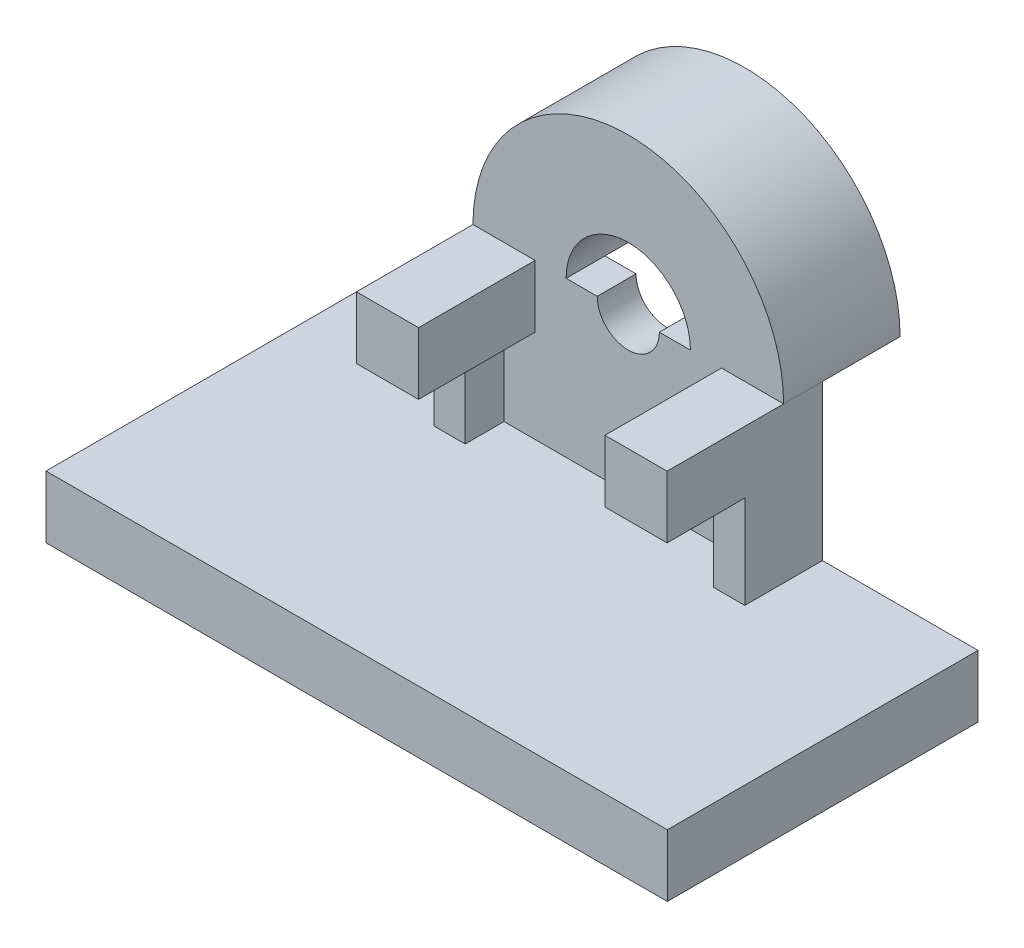
ISO-10303-21;
HEADER;
FILE_DESCRIPTION(('STEP AP214'),'2;1');
FILE_NAME('part.step','',(''),(''),'','','');
FILE_SCHEMA(('AUTOMOTIVE_DESIGN { 1 0 10303 214 1 1 1 1 }'));
ENDSEC;
DATA;
#1=APPLICATION_CONTEXT('core data for automotive mechanical design processes');
#2=APPLICATION_PROTOCOL_DEFINITION('international standard','automotive_design',2000,#1);
#3=PRODUCT_CONTEXT('',#1,'mechanical');
#4=PRODUCT('Part','Part','',(#3));
#5=PRODUCT_RELATED_PRODUCT_CATEGORY('part','',(#4));
#6=PRODUCT_DEFINITION_FORMATION('','',#4);
#7=PRODUCT_DEFINITION_CONTEXT('part definition',#1,'design');
#8=PRODUCT_DEFINITION('design','',#6,#7);
#9=PRODUCT_DEFINITION_SHAPE('','',#8);
#10=(LENGTH_UNIT() NAMED_UNIT(*) SI_UNIT(.MILLI.,.METRE.));
#11=(NAMED_UNIT(*) PLANE_ANGLE_UNIT() SI_UNIT($,.RADIAN.));
#12=(NAMED_UNIT(*) SI_UNIT($,.STERADIAN.) SOLID_ANGLE_UNIT());
#13=UNCERTAINTY_MEASURE_WITH_UNIT(LENGTH_MEASURE(1.E-05),#10,'distance_accuracy_value','');
#14=(GEOMETRIC_REPRESENTATION_CONTEXT(3) GLOBAL_UNCERTAINTY_ASSIGNED_CONTEXT((#13)) GLOBAL_UNIT_ASSIGNED_CONTEXT((#10,
#11,#12)) REPRESENTATION_CONTEXT('',''));
#15=CARTESIAN_POINT('',(0.,0.,0.));
#16=DIRECTION('',(0.,0.,1.));
#17=DIRECTION('',(1.,0.,0.));
#18=AXIS2_PLACEMENT_3D('',#15,#16,#17);
#19=CARTESIAN_POINT('',(0.,-21.9264112903226,50.));
#20=DIRECTION('',(0.,-1.,0.));
#21=DIRECTION('',(1.,0.,0.));
#22=AXIS2_PLACEMENT_3D('',#19,#20,#21);
#23=PLANE('',#22);
#24=DIRECTION('',(0.,0.,-1.));
#25=VECTOR('',#24,1.);
#26=CARTESIAN_POINT('',(26.8689516129032,-21.9264112903226,12.5));
#27=LINE('',#26,#25);
#28=CARTESIAN_POINT('',(26.8689516129032,-21.9264112903226,12.5));
#29=VERTEX_POINT('',#28);
#30=CARTESIAN_POINT('',(26.8689516129032,-21.9264112903226,6.25));
#31=VERTEX_POINT('',#30);
#32=EDGE_CURVE('E332',#29,#31,#27,.T.);
#33=ORIENTED_EDGE('',*,*,#32,.T.);
#34=DIRECTION('',(-1.,0.,0.));
#35=VECTOR('',#34,1.);
#36=CARTESIAN_POINT('',(0.,-21.9264112903226,6.25));
#37=LINE('',#36,#35);
#38=CARTESIAN_POINT('',(-13.1310483870968,-21.9264112903226,6.25));
#39=VERTEX_POINT('',#38);
#40=EDGE_CURVE('E266',#31,#39,#37,.T.);
#41=ORIENTED_EDGE('',*,*,#40,.T.);
#42=DIRECTION('',(0.,0.,-1.));
#43=VECTOR('',#42,1.);
#44=CARTESIAN_POINT('',(-13.1310483870968,-21.9264112903226,12.5));
#45=LINE('',#44,#43);
#46=CARTESIAN_POINT('',(-13.1310483870968,-21.9264112903226,12.5));
#47=VERTEX_POINT('',#46);
#48=EDGE_CURVE('E372',#47,#39,#45,.T.);
#49=ORIENTED_EDGE('',*,*,#48,.F.);
#50=DIRECTION('',(-1.,0.,0.));
#51=VECTOR('',#50,1.);
#52=CARTESIAN_POINT('',(0.,-21.9264112903226,12.5));
#53=LINE('',#52,#51);
#54=CARTESIAN_POINT('',(-18.1310483870968,-21.9264112903226,12.5));
#55=VERTEX_POINT('',#54);
#56=EDGE_CURVE('E369',#47,#55,#53,.T.);
#57=ORIENTED_EDGE('',*,*,#56,.T.);
#58=DIRECTION('',(0.,0.,-1.));
#59=VECTOR('',#58,1.);
#60=CARTESIAN_POINT('',(-18.1310483870968,-21.9264112903226,12.5));
#61=LINE('',#60,#59);
#62=CARTESIAN_POINT('',(-18.1310483870968,-21.9264112903226,0.));
#63=VERTEX_POINT('',#62);
#64=EDGE_CURVE('E377',#55,#63,#61,.T.);
#65=ORIENTED_EDGE('',*,*,#64,.T.);
#66=DIRECTION('',(-1.,0.,0.));
#67=VECTOR('',#66,1.);
#68=CARTESIAN_POINT('',(0.,-21.9264112903226,0.));
#69=LINE('',#68,#67);
#70=CARTESIAN_POINT('',(-43.0940860215054,-21.9264112903226,0.));
#71=VERTEX_POINT('',#70);
#72=EDGE_CURVE('E383',#63,#71,#69,.T.);
#73=ORIENTED_EDGE('',*,*,#72,.T.);
#74=DIRECTION('',(0.,0.,-1.));
#75=VECTOR('',#74,1.);
#76=CARTESIAN_POINT('',(-43.0940860215054,-21.9264112903226,50.));
#77=LINE('',#76,#75);
#78=CARTESIAN_POINT('',(-43.0940860215054,-21.9264112903226,50.));
#79=VERTEX_POINT('',#78);
#80=EDGE_CURVE('E11',#79,#71,#77,.T.);
#81=ORIENTED_EDGE('',*,*,#80,.F.);
#82=DIRECTION('',(-1.,0.,0.));
#83=VECTOR('',#82,1.);
#84=CARTESIAN_POINT('',(0.,-21.9264112903226,50.));
#85=LINE('',#84,#83);
#86=CARTESIAN_POINT('',(56.9059139784946,-21.9264112903226,50.));
#87=VERTEX_POINT('',#86);
#88=EDGE_CURVE('E384',#87,#79,#85,.T.);
#89=ORIENTED_EDGE('',*,*,#88,.F.);
#90=DIRECTION('',(0.,0.,-1.));
#91=VECTOR('',#90,1.);
#92=CARTESIAN_POINT('',(56.9059139784946,-21.9264112903226,50.));
#93=LINE('',#92,#91);
#94=CARTESIAN_POINT('',(56.9059139784946,-21.9264112903226,0.));
#95=VERTEX_POINT('',#94);
#96=EDGE_CURVE('E394',#87,#95,#93,.T.);
#97=ORIENTED_EDGE('',*,*,#96,.T.);
#98=CARTESIAN_POINT('',(31.8689516129032,-21.9264112903226,0.));
#99=VERTEX_POINT('',#98);
#100=EDGE_CURVE('E395',#95,#99,#69,.T.);
#101=ORIENTED_EDGE('',*,*,#100,.T.);
#102=DIRECTION('',(0.,0.,-1.));
#103=VECTOR('',#102,1.);
#104=CARTESIAN_POINT('',(31.8689516129032,-21.9264112903226,12.5));
#105=LINE('',#104,#103);
#106=CARTESIAN_POINT('',(31.8689516129032,-21.9264112903226,12.5));
#107=VERTEX_POINT('',#106);
#108=EDGE_CURVE('E54',#107,#99,#105,.T.);
#109=ORIENTED_EDGE('',*,*,#108,.F.);
#110=DIRECTION('',(-1.,0.,0.));
#111=VECTOR('',#110,1.);
#112=CARTESIAN_POINT('',(0.,-21.9264112903226,12.5));
#113=LINE('',#112,#111);
#114=EDGE_CURVE('E49',#107,#29,#113,.T.);
#115=ORIENTED_EDGE('',*,*,#114,.T.);
#116=EDGE_LOOP('',(#33,#41,#49,#57,#65,#73,#81,#89,#97,#101,#109,#115));
#117=FACE_BOUND('',#116,.T.);
#118=ADVANCED_FACE('F35',(#117),#23,.F.);
#119=CARTESIAN_POINT('',(-43.0940860215054,0.,50.));
#120=DIRECTION('',(1.,0.,0.));
#121=DIRECTION('',(0.,0.,-1.));
#122=AXIS2_PLACEMENT_3D('',#119,#120,#121);
#123=PLANE('',#122);
#124=DIRECTION('',(0.,-1.,0.));
#125=VECTOR('',#124,1.);
#126=CARTESIAN_POINT('',(-43.0940860215054,0.,0.));
#127=LINE('',#126,#125);
#128=CARTESIAN_POINT('',(-43.0940860215054,-31.9264112903226,0.));
#129=VERTEX_POINT('',#128);
#130=EDGE_CURVE('E397',#71,#129,#127,.T.);
#131=ORIENTED_EDGE('',*,*,#130,.T.);
#132=DIRECTION('',(0.,0.,-1.));
#133=VECTOR('',#132,1.);
#134=CARTESIAN_POINT('',(-43.0940860215054,-31.9264112903226,50.));
#135=LINE('',#134,#133);
#136=CARTESIAN_POINT('',(-43.0940860215054,-31.9264112903226,50.));
#137=VERTEX_POINT('',#136);
#138=EDGE_CURVE('E42',#137,#129,#135,.T.);
#139=ORIENTED_EDGE('',*,*,#138,.F.);
#140=DIRECTION('',(0.,-1.,0.));
#141=VECTOR('',#140,1.);
#142=CARTESIAN_POINT('',(-43.0940860215054,0.,50.));
#143=LINE('',#142,#141);
#144=EDGE_CURVE('E387',#79,#137,#143,.T.);
#145=ORIENTED_EDGE('',*,*,#144,.F.);
#146=ORIENTED_EDGE('',*,*,#80,.T.);
#147=EDGE_LOOP('',(#131,#139,#145,#146));
#148=FACE_BOUND('',#147,.T.);
#149=ADVANCED_FACE('F429',(#148),#123,.F.);
#150=CARTESIAN_POINT('',(0.,-31.9264112903226,50.));
#151=DIRECTION('',(0.,1.,0.));
#152=DIRECTION('',(0.,0.,1.));
#153=AXIS2_PLACEMENT_3D('',#150,#151,#152);
#154=PLANE('',#153);
#155=DIRECTION('',(1.,0.,0.));
#156=VECTOR('',#155,1.);
#157=CARTESIAN_POINT('',(0.,-31.9264112903226,0.));
#158=LINE('',#157,#156);
#159=CARTESIAN_POINT('',(56.9059139784946,-31.9264112903226,0.));
#160=VERTEX_POINT('',#159);
#161=EDGE_CURVE('E399',#129,#160,#158,.T.);
#162=ORIENTED_EDGE('',*,*,#161,.T.);
#163=DIRECTION('',(0.,0.,-1.));
#164=VECTOR('',#163,1.);
#165=CARTESIAN_POINT('',(56.9059139784946,-31.9264112903226,50.));
#166=LINE('',#165,#164);
#167=CARTESIAN_POINT('',(56.9059139784946,-31.9264112903226,50.));
#168=VERTEX_POINT('',#167);
#169=EDGE_CURVE('E404',#168,#160,#166,.T.);
#170=ORIENTED_EDGE('',*,*,#169,.F.);
#171=DIRECTION('',(1.,0.,0.));
#172=VECTOR('',#171,1.);
#173=CARTESIAN_POINT('',(0.,-31.9264112903226,50.));
#174=LINE('',#173,#172);
#175=EDGE_CURVE('E390',#137,#168,#174,.T.);
#176=ORIENTED_EDGE('',*,*,#175,.F.);
#177=ORIENTED_EDGE('',*,*,#138,.T.);
#178=EDGE_LOOP('',(#162,#170,#176,#177));
#179=FACE_BOUND('',#178,.T.);
#180=ADVANCED_FACE('F411',(#179),#154,.F.);
#181=CARTESIAN_POINT('',(56.9059139784946,0.,50.));
#182=DIRECTION('',(-1.,0.,0.));
#183=DIRECTION('',(0.,0.,1.));
#184=AXIS2_PLACEMENT_3D('',#181,#182,#183);
#185=PLANE('',#184);
#186=DIRECTION('',(0.,1.,0.));
#187=VECTOR('',#186,1.);
#188=CARTESIAN_POINT('',(56.9059139784946,0.,0.));
#189=LINE('',#188,#187);
#190=EDGE_CURVE('E388',#160,#95,#189,.T.);
#191=ORIENTED_EDGE('',*,*,#190,.T.);
#192=ORIENTED_EDGE('',*,*,#96,.F.);
#193=DIRECTION('',(0.,1.,0.));
#194=VECTOR('',#193,1.);
#195=CARTESIAN_POINT('',(56.9059139784946,0.,50.));
#196=LINE('',#195,#194);
#197=EDGE_CURVE('E392',#168,#87,#196,.T.);
#198=ORIENTED_EDGE('',*,*,#197,.F.);
#199=ORIENTED_EDGE('',*,*,#169,.T.);
#200=EDGE_LOOP('',(#191,#192,#198,#199));
#201=FACE_BOUND('',#200,.T.);
#202=ADVANCED_FACE('F423',(#201),#185,.F.);
#203=CARTESIAN_POINT('',(0.,0.,50.));
#204=DIRECTION('',(0.,0.,1.));
#205=DIRECTION('',(1.,0.,0.));
#206=AXIS2_PLACEMENT_3D('',#203,#204,#205);
#207=PLANE('',#206);
#208=ORIENTED_EDGE('',*,*,#88,.T.);
#209=ORIENTED_EDGE('',*,*,#144,.T.);
#210=ORIENTED_EDGE('',*,*,#175,.T.);
#211=ORIENTED_EDGE('',*,*,#197,.T.);
#212=EDGE_LOOP('',(#208,#209,#210,#211));
#213=FACE_BOUND('',#212,.T.);
#214=ADVANCED_FACE('F428',(#213),#207,.T.);
#215=CARTESIAN_POINT('',(0.,0.,0.));
#216=DIRECTION('',(0.,0.,1.));
#217=DIRECTION('',(1.,0.,0.));
#218=AXIS2_PLACEMENT_3D('',#215,#216,#217);
#219=PLANE('',#218);
#220=DIRECTION('',(1.,0.,0.));
#221=VECTOR('',#220,1.);
#222=CARTESIAN_POINT('',(0.,3.03662634408602,0.));
#223=LINE('',#222,#221);
#224=CARTESIAN_POINT('',(11.8689516129032,3.03662634408602,0.));
#225=VERTEX_POINT('',#224);
#226=CARTESIAN_POINT('',(16.8689516129032,3.03662634408602,0.));
#227=VERTEX_POINT('',#226);
#228=EDGE_CURVE('E282',#225,#227,#223,.T.);
#229=ORIENTED_EDGE('',*,*,#228,.T.);
#230=DIRECTION('',(1.,0.,0.));
#231=VECTOR('',#230,1.);
#232=CARTESIAN_POINT('',(0.,3.03662634408602,0.));
#233=LINE('',#232,#231);
#234=CARTESIAN_POINT('',(31.8689516129032,3.03662634408603,0.));
#235=VERTEX_POINT('',#234);
#236=EDGE_CURVE('E206',#227,#235,#233,.T.);
#237=ORIENTED_EDGE('',*,*,#236,.T.);
#238=DIRECTION('',(0.,-1.,0.));
#239=VECTOR('',#238,1.);
#240=CARTESIAN_POINT('',(31.8689516129032,0.,0.));
#241=LINE('',#240,#239);
#242=EDGE_CURVE('E319',#235,#99,#241,.T.);
#243=ORIENTED_EDGE('',*,*,#242,.T.);
#244=ORIENTED_EDGE('',*,*,#100,.F.);
#245=ORIENTED_EDGE('',*,*,#190,.F.);
#246=ORIENTED_EDGE('',*,*,#161,.F.);
#247=ORIENTED_EDGE('',*,*,#130,.F.);
#248=ORIENTED_EDGE('',*,*,#72,.F.);
#249=DIRECTION('',(0.,1.,0.));
#250=VECTOR('',#249,1.);
#251=CARTESIAN_POINT('',(-18.1310483870968,0.,0.));
#252=LINE('',#251,#250);
#253=CARTESIAN_POINT('',(-18.1310483870968,3.03662634408602,0.));
#254=VERTEX_POINT('',#253);
#255=EDGE_CURVE('E361',#63,#254,#252,.T.);
#256=ORIENTED_EDGE('',*,*,#255,.T.);
#257=CARTESIAN_POINT('',(-3.13104838709678,3.03662634408602,0.));
#258=VERTEX_POINT('',#257);
#259=EDGE_CURVE('E220',#254,#258,#233,.T.);
#260=ORIENTED_EDGE('',*,*,#259,.T.);
#261=CARTESIAN_POINT('',(1.86895161290322,3.03662634408602,0.));
#262=VERTEX_POINT('',#261);
#263=EDGE_CURVE('E279',#258,#262,#223,.T.);
#264=ORIENTED_EDGE('',*,*,#263,.T.);
#265=CARTESIAN_POINT('',(6.86895161290322,3.03662634408602,0.));
#266=DIRECTION('',(0.,0.,1.));
#267=DIRECTION('',(1.,0.,0.));
#268=AXIS2_PLACEMENT_3D('',#265,#266,#267);
#269=CIRCLE('',#268,5.);
#270=EDGE_CURVE('E250',#262,#225,#269,.T.);
#271=ORIENTED_EDGE('',*,*,#270,.T.);
#272=EDGE_LOOP('',(#229,#237,#243,#244,#245,#246,#247,#248,#256,#260,#264,#271));
#273=FACE_BOUND('',#272,.T.);
#274=ADVANCED_FACE('F418',(#273),#219,.F.);
#275=CARTESIAN_POINT('',(-13.1310483870968,0.,12.5));
#276=DIRECTION('',(1.,0.,0.));
#277=DIRECTION('',(0.,1.,0.));
#278=AXIS2_PLACEMENT_3D('',#275,#276,#277);
#279=PLANE('',#278);
#280=DIRECTION('',(0.,-1.,0.));
#281=VECTOR('',#280,1.);
#282=CARTESIAN_POINT('',(-13.1310483870968,0.,6.25));
#283=LINE('',#282,#281);
#284=CARTESIAN_POINT('',(-13.1310483870968,-6.96337365591398,6.25));
#285=VERTEX_POINT('',#284);
#286=EDGE_CURVE('E264',#285,#39,#283,.T.);
#287=ORIENTED_EDGE('',*,*,#286,.F.);
#288=DIRECTION('',(0.,0.,-1.));
#289=VECTOR('',#288,1.);
#290=CARTESIAN_POINT('',(-13.1310483870968,-6.96337365591398,12.5));
#291=LINE('',#290,#289);
#292=CARTESIAN_POINT('',(-13.1310483870968,-6.96337365591398,12.5));
#293=VERTEX_POINT('',#292);
#294=EDGE_CURVE('E380',#293,#285,#291,.T.);
#295=ORIENTED_EDGE('',*,*,#294,.F.);
#296=DIRECTION('',(0.,-1.,0.));
#297=VECTOR('',#296,1.);
#298=CARTESIAN_POINT('',(-13.1310483870968,0.,12.5));
#299=LINE('',#298,#297);
#300=EDGE_CURVE('E362',#293,#47,#299,.T.);
#301=ORIENTED_EDGE('',*,*,#300,.T.);
#302=ORIENTED_EDGE('',*,*,#48,.T.);
#303=EDGE_LOOP('',(#287,#295,#301,#302));
#304=FACE_BOUND('',#303,.T.);
#305=ADVANCED_FACE('F441',(#304),#279,.T.);
#306=CARTESIAN_POINT('',(-18.1310483870968,0.,12.5));
#307=DIRECTION('',(-1.,0.,0.));
#308=DIRECTION('',(0.,0.,1.));
#309=AXIS2_PLACEMENT_3D('',#306,#307,#308);
#310=PLANE('',#309);
#311=ORIENTED_EDGE('',*,*,#255,.F.);
#312=ORIENTED_EDGE('',*,*,#64,.F.);
#313=DIRECTION('',(0.,1.,0.));
#314=VECTOR('',#313,1.);
#315=CARTESIAN_POINT('',(-18.1310483870968,0.,12.5));
#316=LINE('',#315,#314);
#317=CARTESIAN_POINT('',(-18.1310483870968,-6.96337365591399,12.5));
#318=VERTEX_POINT('',#317);
#319=EDGE_CURVE('E366',#55,#318,#316,.T.);
#320=ORIENTED_EDGE('',*,*,#319,.T.);
#321=DIRECTION('',(0.,0.,-1.));
#322=VECTOR('',#321,1.);
#323=CARTESIAN_POINT('',(-18.1310483870968,-6.96337365591399,25.));
#324=LINE('',#323,#322);
#325=CARTESIAN_POINT('',(-18.1310483870968,-6.96337365591399,25.));
#326=VERTEX_POINT('',#325);
#327=EDGE_CURVE('E349',#326,#318,#324,.T.);
#328=ORIENTED_EDGE('',*,*,#327,.F.);
#329=DIRECTION('',(0.,1.,0.));
#330=VECTOR('',#329,1.);
#331=CARTESIAN_POINT('',(-18.1310483870968,0.,25.));
#332=LINE('',#331,#330);
#333=CARTESIAN_POINT('',(-18.1310483870968,3.03662634408602,25.));
#334=VERTEX_POINT('',#333);
#335=EDGE_CURVE('E346',#326,#334,#332,.T.);
#336=ORIENTED_EDGE('',*,*,#335,.T.);
#337=DIRECTION('',(0.,0.,-1.));
#338=VECTOR('',#337,1.);
#339=CARTESIAN_POINT('',(-18.1310483870968,3.03662634408602,25.));
#340=LINE('',#339,#338);
#341=CARTESIAN_POINT('',(-18.1310483870968,3.03662634408602,6.25));
#342=VERTEX_POINT('',#341);
#343=EDGE_CURVE('E352',#334,#342,#340,.T.);
#344=ORIENTED_EDGE('',*,*,#343,.T.);
#345=DIRECTION('',(0.,0.,-1.));
#346=VECTOR('',#345,1.);
#347=CARTESIAN_POINT('',(-18.1310483870968,3.03662634408602,6.25));
#348=LINE('',#347,#346);
#349=EDGE_CURVE('E285',#342,#254,#348,.T.);
#350=ORIENTED_EDGE('',*,*,#349,.T.);
#351=EDGE_LOOP('',(#311,#312,#320,#328,#336,#344,#350));
#352=FACE_BOUND('',#351,.T.);
#353=ADVANCED_FACE('F446',(#352),#310,.T.);
#354=CARTESIAN_POINT('',(0.,0.,12.5));
#355=DIRECTION('',(0.,0.,1.));
#356=DIRECTION('',(1.,0.,0.));
#357=AXIS2_PLACEMENT_3D('',#354,#355,#356);
#358=PLANE('',#357);
#359=ORIENTED_EDGE('',*,*,#300,.F.);
#360=DIRECTION('',(-1.,0.,0.));
#361=VECTOR('',#360,1.);
#362=CARTESIAN_POINT('',(0.,-6.96337365591398,12.5));
#363=LINE('',#362,#361);
#364=EDGE_CURVE('E364',#293,#318,#363,.T.);
#365=ORIENTED_EDGE('',*,*,#364,.T.);
#366=ORIENTED_EDGE('',*,*,#319,.F.);
#367=ORIENTED_EDGE('',*,*,#56,.F.);
#368=EDGE_LOOP('',(#359,#365,#366,#367));
#369=FACE_BOUND('',#368,.T.);
#370=ADVANCED_FACE('F450',(#369),#358,.T.);
#371=CARTESIAN_POINT('',(0.,-6.96337365591398,25.));
#372=DIRECTION('',(0.,-1.,0.));
#373=DIRECTION('',(1.,0.,0.));
#374=AXIS2_PLACEMENT_3D('',#371,#372,#373);
#375=PLANE('',#374);
#376=DIRECTION('',(-1.,0.,0.));
#377=VECTOR('',#376,1.);
#378=CARTESIAN_POINT('',(0.,-6.96337365591398,6.25));
#379=LINE('',#378,#377);
#380=CARTESIAN_POINT('',(-8.13104838709678,-6.96337365591398,6.25));
#381=VERTEX_POINT('',#380);
#382=EDGE_CURVE('E262',#381,#285,#379,.T.);
#383=ORIENTED_EDGE('',*,*,#382,.F.);
#384=DIRECTION('',(0.,0.,-1.));
#385=VECTOR('',#384,1.);
#386=CARTESIAN_POINT('',(-8.13104838709678,-6.96337365591398,25.));
#387=LINE('',#386,#385);
#388=CARTESIAN_POINT('',(-8.13104838709678,-6.96337365591398,25.));
#389=VERTEX_POINT('',#388);
#390=EDGE_CURVE('E358',#389,#381,#387,.T.);
#391=ORIENTED_EDGE('',*,*,#390,.F.);
#392=DIRECTION('',(-1.,0.,0.));
#393=VECTOR('',#392,1.);
#394=CARTESIAN_POINT('',(0.,-6.96337365591398,25.));
#395=LINE('',#394,#393);
#396=EDGE_CURVE('E337',#389,#326,#395,.T.);
#397=ORIENTED_EDGE('',*,*,#396,.T.);
#398=ORIENTED_EDGE('',*,*,#327,.T.);
#399=ORIENTED_EDGE('',*,*,#364,.F.);
#400=ORIENTED_EDGE('',*,*,#294,.T.);
#401=EDGE_LOOP('',(#383,#391,#397,#398,#399,#400));
#402=FACE_BOUND('',#401,.T.);
#403=ADVANCED_FACE('F454',(#402),#375,.T.);
#404=CARTESIAN_POINT('',(-8.13104838709678,0.,25.));
#405=DIRECTION('',(1.,0.,0.));
#406=DIRECTION('',(0.,1.,0.));
#407=AXIS2_PLACEMENT_3D('',#404,#405,#406);
#408=PLANE('',#407);
#409=DIRECTION('',(0.,-1.,0.));
#410=VECTOR('',#409,1.);
#411=CARTESIAN_POINT('',(-8.13104838709678,0.,6.25));
#412=LINE('',#411,#410);
#413=CARTESIAN_POINT('',(-8.13104838709678,3.03662634408602,6.25));
#414=VERTEX_POINT('',#413);
#415=EDGE_CURVE('E259',#414,#381,#412,.T.);
#416=ORIENTED_EDGE('',*,*,#415,.F.);
#417=DIRECTION('',(0.,0.,-1.));
#418=VECTOR('',#417,1.);
#419=CARTESIAN_POINT('',(-8.13104838709678,3.03662634408602,25.));
#420=LINE('',#419,#418);
#421=CARTESIAN_POINT('',(-8.13104838709678,3.03662634408602,25.));
#422=VERTEX_POINT('',#421);
#423=EDGE_CURVE('E355',#422,#414,#420,.T.);
#424=ORIENTED_EDGE('',*,*,#423,.F.);
#425=DIRECTION('',(0.,-1.,0.));
#426=VECTOR('',#425,1.);
#427=CARTESIAN_POINT('',(-8.13104838709678,0.,25.));
#428=LINE('',#427,#426);
#429=EDGE_CURVE('E340',#422,#389,#428,.T.);
#430=ORIENTED_EDGE('',*,*,#429,.T.);
#431=ORIENTED_EDGE('',*,*,#390,.T.);
#432=EDGE_LOOP('',(#416,#424,#430,#431));
#433=FACE_BOUND('',#432,.T.);
#434=ADVANCED_FACE('F458',(#433),#408,.T.);
#435=CARTESIAN_POINT('',(0.,3.03662634408602,25.));
#436=DIRECTION('',(0.,1.,0.));
#437=DIRECTION('',(-1.,0.,0.));
#438=AXIS2_PLACEMENT_3D('',#435,#436,#437);
#439=PLANE('',#438);
#440=DIRECTION('',(1.,0.,0.));
#441=VECTOR('',#440,1.);
#442=CARTESIAN_POINT('',(0.,3.03662634408602,6.25));
#443=LINE('',#442,#441);
#444=EDGE_CURVE('E257',#342,#414,#443,.T.);
#445=ORIENTED_EDGE('',*,*,#444,.F.);
#446=ORIENTED_EDGE('',*,*,#343,.F.);
#447=DIRECTION('',(1.,0.,0.));
#448=VECTOR('',#447,1.);
#449=CARTESIAN_POINT('',(0.,3.03662634408602,25.));
#450=LINE('',#449,#448);
#451=EDGE_CURVE('E343',#334,#422,#450,.T.);
#452=ORIENTED_EDGE('',*,*,#451,.T.);
#453=ORIENTED_EDGE('',*,*,#423,.T.);
#454=EDGE_LOOP('',(#445,#446,#452,#453));
#455=FACE_BOUND('',#454,.T.);
#456=ADVANCED_FACE('F462',(#455),#439,.T.);
#457=CARTESIAN_POINT('',(0.,0.,25.));
#458=DIRECTION('',(0.,0.,1.));
#459=DIRECTION('',(1.,0.,0.));
#460=AXIS2_PLACEMENT_3D('',#457,#458,#459);
#461=PLANE('',#460);
#462=ORIENTED_EDGE('',*,*,#396,.F.);
#463=ORIENTED_EDGE('',*,*,#429,.F.);
#464=ORIENTED_EDGE('',*,*,#451,.F.);
#465=ORIENTED_EDGE('',*,*,#335,.F.);
#466=EDGE_LOOP('',(#462,#463,#464,#465));
#467=FACE_BOUND('',#466,.T.);
#468=ADVANCED_FACE('F466',(#467),#461,.T.);
#469=CARTESIAN_POINT('',(26.8689516129032,0.,12.5));
#470=DIRECTION('',(1.,0.,0.));
#471=DIRECTION('',(0.,0.,-1.));
#472=AXIS2_PLACEMENT_3D('',#469,#470,#471);
#473=PLANE('',#472);
#474=DIRECTION('',(0.,0.,-1.));
#475=VECTOR('',#474,1.);
#476=CARTESIAN_POINT('',(26.8689516129032,-6.96337365591398,12.5));
#477=LINE('',#476,#475);
#478=CARTESIAN_POINT('',(26.8689516129032,-6.96337365591398,12.5));
#479=VERTEX_POINT('',#478);
#480=CARTESIAN_POINT('',(26.8689516129032,-6.96337365591398,6.25));
#481=VERTEX_POINT('',#480);
#482=EDGE_CURVE('E334',#479,#481,#477,.T.);
#483=ORIENTED_EDGE('',*,*,#482,.T.);
#484=DIRECTION('',(0.,-1.,0.));
#485=VECTOR('',#484,1.);
#486=CARTESIAN_POINT('',(26.8689516129032,0.,6.25));
#487=LINE('',#486,#485);
#488=EDGE_CURVE('E269',#481,#31,#487,.T.);
#489=ORIENTED_EDGE('',*,*,#488,.T.);
#490=ORIENTED_EDGE('',*,*,#32,.F.);
#491=DIRECTION('',(0.,-1.,0.));
#492=VECTOR('',#491,1.);
#493=CARTESIAN_POINT('',(26.8689516129032,0.,12.5));
#494=LINE('',#493,#492);
#495=EDGE_CURVE('E323',#479,#29,#494,.T.);
#496=ORIENTED_EDGE('',*,*,#495,.F.);
#497=EDGE_LOOP('',(#483,#489,#490,#496));
#498=FACE_BOUND('',#497,.T.);
#499=ADVANCED_FACE('F470',(#498),#473,.F.);
#500=CARTESIAN_POINT('',(31.8689516129032,0.,12.5));
#501=DIRECTION('',(1.,0.,0.));
#502=DIRECTION('',(0.,0.,-1.));
#503=AXIS2_PLACEMENT_3D('',#500,#501,#502);
#504=PLANE('',#503);
#505=ORIENTED_EDGE('',*,*,#242,.F.);
#506=DIRECTION('',(0.,0.,-1.));
#507=VECTOR('',#506,1.);
#508=CARTESIAN_POINT('',(31.8689516129032,3.03662634408603,6.25));
#509=LINE('',#508,#507);
#510=CARTESIAN_POINT('',(31.8689516129032,3.03662634408603,6.25));
#511=VERTEX_POINT('',#510);
#512=EDGE_CURVE('E241',#511,#235,#509,.T.);
#513=ORIENTED_EDGE('',*,*,#512,.F.);
#514=DIRECTION('',(0.,0.,-1.));
#515=VECTOR('',#514,1.);
#516=CARTESIAN_POINT('',(31.8689516129032,3.03662634408603,25.));
#517=LINE('',#516,#515);
#518=CARTESIAN_POINT('',(31.8689516129032,3.03662634408603,25.));
#519=VERTEX_POINT('',#518);
#520=EDGE_CURVE('E310',#519,#511,#517,.T.);
#521=ORIENTED_EDGE('',*,*,#520,.F.);
#522=DIRECTION('',(0.,-1.,0.));
#523=VECTOR('',#522,1.);
#524=CARTESIAN_POINT('',(31.8689516129032,0.,25.));
#525=LINE('',#524,#523);
#526=CARTESIAN_POINT('',(31.8689516129032,-6.96337365591398,25.));
#527=VERTEX_POINT('',#526);
#528=EDGE_CURVE('E301',#519,#527,#525,.T.);
#529=ORIENTED_EDGE('',*,*,#528,.T.);
#530=DIRECTION('',(0.,0.,-1.));
#531=VECTOR('',#530,1.);
#532=CARTESIAN_POINT('',(31.8689516129032,-6.96337365591398,25.));
#533=LINE('',#532,#531);
#534=CARTESIAN_POINT('',(31.8689516129032,-6.96337365591398,12.5));
#535=VERTEX_POINT('',#534);
#536=EDGE_CURVE('E313',#527,#535,#533,.T.);
#537=ORIENTED_EDGE('',*,*,#536,.T.);
#538=DIRECTION('',(0.,-1.,0.));
#539=VECTOR('',#538,1.);
#540=CARTESIAN_POINT('',(31.8689516129032,0.,12.5));
#541=LINE('',#540,#539);
#542=EDGE_CURVE('E326',#535,#107,#541,.T.);
#543=ORIENTED_EDGE('',*,*,#542,.T.);
#544=ORIENTED_EDGE('',*,*,#108,.T.);
#545=EDGE_LOOP('',(#505,#513,#521,#529,#537,#543,#544));
#546=FACE_BOUND('',#545,.T.);
#547=ADVANCED_FACE('F474',(#546),#504,.T.);
#548=CARTESIAN_POINT('',(0.,0.,12.5));
#549=DIRECTION('',(0.,0.,1.));
#550=DIRECTION('',(1.,0.,0.));
#551=AXIS2_PLACEMENT_3D('',#548,#549,#550);
#552=PLANE('',#551);
#553=DIRECTION('',(-1.,0.,0.));
#554=VECTOR('',#553,1.);
#555=CARTESIAN_POINT('',(0.,-6.96337365591399,12.5));
#556=LINE('',#555,#554);
#557=EDGE_CURVE('E320',#535,#479,#556,.T.);
#558=ORIENTED_EDGE('',*,*,#557,.T.);
#559=ORIENTED_EDGE('',*,*,#495,.T.);
#560=ORIENTED_EDGE('',*,*,#114,.F.);
#561=ORIENTED_EDGE('',*,*,#542,.F.);
#562=EDGE_LOOP('',(#558,#559,#560,#561));
#563=FACE_BOUND('',#562,.T.);
#564=ADVANCED_FACE('F478',(#563),#552,.T.);
#565=CARTESIAN_POINT('',(0.,-6.96337365591399,25.));
#566=DIRECTION('',(0.,-1.,0.));
#567=DIRECTION('',(1.,0.,0.));
#568=AXIS2_PLACEMENT_3D('',#565,#566,#567);
#569=PLANE('',#568);
#570=DIRECTION('',(-1.,0.,0.));
#571=VECTOR('',#570,1.);
#572=CARTESIAN_POINT('',(0.,-6.96337365591399,6.25));
#573=LINE('',#572,#571);
#574=CARTESIAN_POINT('',(21.8689516129032,-6.96337365591398,6.25));
#575=VERTEX_POINT('',#574);
#576=EDGE_CURVE('E272',#481,#575,#573,.T.);
#577=ORIENTED_EDGE('',*,*,#576,.F.);
#578=ORIENTED_EDGE('',*,*,#482,.F.);
#579=ORIENTED_EDGE('',*,*,#557,.F.);
#580=ORIENTED_EDGE('',*,*,#536,.F.);
#581=DIRECTION('',(-1.,0.,0.));
#582=VECTOR('',#581,1.);
#583=CARTESIAN_POINT('',(0.,-6.96337365591399,25.));
#584=LINE('',#583,#582);
#585=CARTESIAN_POINT('',(21.8689516129032,-6.96337365591398,25.));
#586=VERTEX_POINT('',#585);
#587=EDGE_CURVE('E298',#527,#586,#584,.T.);
#588=ORIENTED_EDGE('',*,*,#587,.T.);
#589=DIRECTION('',(0.,0.,-1.));
#590=VECTOR('',#589,1.);
#591=CARTESIAN_POINT('',(21.8689516129032,-6.96337365591398,25.));
#592=LINE('',#591,#590);
#593=EDGE_CURVE('E316',#586,#575,#592,.T.);
#594=ORIENTED_EDGE('',*,*,#593,.T.);
#595=EDGE_LOOP('',(#577,#578,#579,#580,#588,#594));
#596=FACE_BOUND('',#595,.T.);
#597=ADVANCED_FACE('F482',(#596),#569,.T.);
#598=CARTESIAN_POINT('',(21.8689516129032,0.,25.));
#599=DIRECTION('',(-1.,0.,0.));
#600=DIRECTION('',(0.,0.,1.));
#601=AXIS2_PLACEMENT_3D('',#598,#599,#600);
#602=PLANE('',#601);
#603=DIRECTION('',(0.,1.,0.));
#604=VECTOR('',#603,1.);
#605=CARTESIAN_POINT('',(21.8689516129032,0.,6.25));
#606=LINE('',#605,#604);
#607=CARTESIAN_POINT('',(21.8689516129032,3.03662634408602,6.25));
#608=VERTEX_POINT('',#607);
#609=EDGE_CURVE('E274',#575,#608,#606,.T.);
#610=ORIENTED_EDGE('',*,*,#609,.F.);
#611=ORIENTED_EDGE('',*,*,#593,.F.);
#612=DIRECTION('',(0.,1.,0.));
#613=VECTOR('',#612,1.);
#614=CARTESIAN_POINT('',(21.8689516129032,0.,25.));
#615=LINE('',#614,#613);
#616=CARTESIAN_POINT('',(21.8689516129032,3.03662634408602,25.));
#617=VERTEX_POINT('',#616);
#618=EDGE_CURVE('E289',#586,#617,#615,.T.);
#619=ORIENTED_EDGE('',*,*,#618,.T.);
#620=DIRECTION('',(0.,0.,-1.));
#621=VECTOR('',#620,1.);
#622=CARTESIAN_POINT('',(21.8689516129032,3.03662634408602,25.));
#623=LINE('',#622,#621);
#624=EDGE_CURVE('E307',#617,#608,#623,.T.);
#625=ORIENTED_EDGE('',*,*,#624,.T.);
#626=EDGE_LOOP('',(#610,#611,#619,#625));
#627=FACE_BOUND('',#626,.T.);
#628=ADVANCED_FACE('F484',(#627),#602,.T.);
#629=CARTESIAN_POINT('',(0.,3.03662634408602,25.));
#630=DIRECTION('',(0.,1.,0.));
#631=DIRECTION('',(-1.,0.,0.));
#632=AXIS2_PLACEMENT_3D('',#629,#630,#631);
#633=PLANE('',#632);
#634=EDGE_CURVE('E260',#608,#511,#443,.T.);
#635=ORIENTED_EDGE('',*,*,#634,.F.);
#636=ORIENTED_EDGE('',*,*,#624,.F.);
#637=DIRECTION('',(1.,0.,0.));
#638=VECTOR('',#637,1.);
#639=CARTESIAN_POINT('',(0.,3.03662634408602,25.));
#640=LINE('',#639,#638);
#641=EDGE_CURVE('E304',#617,#519,#640,.T.);
#642=ORIENTED_EDGE('',*,*,#641,.T.);
#643=ORIENTED_EDGE('',*,*,#520,.T.);
#644=EDGE_LOOP('',(#635,#636,#642,#643));
#645=FACE_BOUND('',#644,.T.);
#646=ADVANCED_FACE('F487',(#645),#633,.T.);
#647=CARTESIAN_POINT('',(0.,0.,25.));
#648=DIRECTION('',(0.,0.,1.));
#649=DIRECTION('',(1.,0.,0.));
#650=AXIS2_PLACEMENT_3D('',#647,#648,#649);
#651=PLANE('',#650);
#652=ORIENTED_EDGE('',*,*,#618,.F.);
#653=ORIENTED_EDGE('',*,*,#587,.F.);
#654=ORIENTED_EDGE('',*,*,#528,.F.);
#655=ORIENTED_EDGE('',*,*,#641,.F.);
#656=EDGE_LOOP('',(#652,#653,#654,#655));
#657=FACE_BOUND('',#656,.T.);
#658=ADVANCED_FACE('F494',(#657),#651,.T.);
#659=CARTESIAN_POINT('',(0.,3.03662634408602,6.25));
#660=DIRECTION('',(0.,1.,0.));
#661=DIRECTION('',(-1.,0.,0.));
#662=AXIS2_PLACEMENT_3D('',#659,#660,#661);
#663=PLANE('',#662);
#664=ORIENTED_EDGE('',*,*,#263,.F.);
#665=DIRECTION('',(0.,0.,-1.));
#666=VECTOR('',#665,1.);
#667=CARTESIAN_POINT('',(-3.13104838709678,3.03662634408602,6.25));
#668=LINE('',#667,#666);
#669=CARTESIAN_POINT('',(-3.13104838709678,3.03662634408602,6.25));
#670=VERTEX_POINT('',#669);
#671=EDGE_CURVE('E287',#670,#258,#668,.T.);
#672=ORIENTED_EDGE('',*,*,#671,.F.);
#673=DIRECTION('',(1.,0.,0.));
#674=VECTOR('',#673,1.);
#675=CARTESIAN_POINT('',(0.,3.03662634408602,6.25));
#676=LINE('',#675,#674);
#677=CARTESIAN_POINT('',(1.86895161290322,3.03662634408602,6.25));
#678=VERTEX_POINT('',#677);
#679=EDGE_CURVE('E246',#670,#678,#676,.T.);
#680=ORIENTED_EDGE('',*,*,#679,.T.);
#681=DIRECTION('',(0.,0.,-1.));
#682=VECTOR('',#681,1.);
#683=CARTESIAN_POINT('',(1.86895161290322,3.03662634408602,6.25));
#684=LINE('',#683,#682);
#685=EDGE_CURVE('E278',#678,#262,#684,.T.);
#686=ORIENTED_EDGE('',*,*,#685,.T.);
#687=EDGE_LOOP('',(#664,#672,#680,#686));
#688=FACE_BOUND('',#687,.T.);
#689=ADVANCED_FACE('F498',(#688),#663,.T.);
#690=CARTESIAN_POINT('',(6.86895161290322,3.03662634408602,6.25));
#691=DIRECTION('',(0.,0.,-1.));
#692=DIRECTION('',(-1.,0.,0.));
#693=AXIS2_PLACEMENT_3D('',#690,#691,#692);
#694=CYLINDRICAL_SURFACE('',#693,10.);
#695=ORIENTED_EDGE('',*,*,#671,.T.);
#696=DIRECTION('',(0.,0.,1.));
#697=VECTOR('',#696,1.);
#698=CARTESIAN_POINT('',(-3.13104838709678,3.03662634408602,-12.5));
#699=LINE('',#698,#697);
#700=CARTESIAN_POINT('',(-3.13104838709678,3.03662634408602,-12.5));
#701=VERTEX_POINT('',#700);
#702=EDGE_CURVE('E216',#701,#258,#699,.T.);
#703=ORIENTED_EDGE('',*,*,#702,.F.);
#704=CARTESIAN_POINT('',(6.86895161290322,3.03662634408602,-12.5));
#705=DIRECTION('',(0.,0.,1.));
#706=DIRECTION('',(1.,0.,0.));
#707=AXIS2_PLACEMENT_3D('',#704,#705,#706);
#708=CIRCLE('',#707,10.);
#709=CARTESIAN_POINT('',(16.8689516129032,3.03662634408602,-12.5));
#710=VERTEX_POINT('',#709);
#711=EDGE_CURVE('E213',#710,#701,#708,.T.);
#712=ORIENTED_EDGE('',*,*,#711,.F.);
#713=DIRECTION('',(0.,0.,1.));
#714=VECTOR('',#713,1.);
#715=CARTESIAN_POINT('',(16.8689516129032,3.03662634408602,-12.5));
#716=LINE('',#715,#714);
#717=EDGE_CURVE('E200',#710,#227,#716,.T.);
#718=ORIENTED_EDGE('',*,*,#717,.T.);
#719=DIRECTION('',(0.,0.,-1.));
#720=VECTOR('',#719,1.);
#721=CARTESIAN_POINT('',(16.8689516129032,3.03662634408602,6.25));
#722=LINE('',#721,#720);
#723=CARTESIAN_POINT('',(16.8689516129032,3.03662634408602,6.25));
#724=VERTEX_POINT('',#723);
#725=EDGE_CURVE('E293',#724,#227,#722,.T.);
#726=ORIENTED_EDGE('',*,*,#725,.F.);
#727=CARTESIAN_POINT('',(6.86895161290322,3.03662634408602,6.25));
#728=DIRECTION('',(0.,0.,1.));
#729=DIRECTION('',(1.,0.,0.));
#730=AXIS2_PLACEMENT_3D('',#727,#728,#729);
#731=CIRCLE('',#730,10.);
#732=EDGE_CURVE('E249',#724,#670,#731,.T.);
#733=ORIENTED_EDGE('',*,*,#732,.T.);
#734=EDGE_LOOP('',(#695,#703,#712,#718,#726,#733));
#735=FACE_BOUND('',#734,.T.);
#736=ADVANCED_FACE('F215',(#735),#694,.F.);
#737=ORIENTED_EDGE('',*,*,#228,.F.);
#738=DIRECTION('',(0.,0.,-1.));
#739=VECTOR('',#738,1.);
#740=CARTESIAN_POINT('',(11.8689516129032,3.03662634408602,6.25));
#741=LINE('',#740,#739);
#742=CARTESIAN_POINT('',(11.8689516129032,3.03662634408602,6.25));
#743=VERTEX_POINT('',#742);
#744=EDGE_CURVE('E291',#743,#225,#741,.T.);
#745=ORIENTED_EDGE('',*,*,#744,.F.);
#746=EDGE_CURVE('E251',#743,#724,#676,.T.);
#747=ORIENTED_EDGE('',*,*,#746,.T.);
#748=ORIENTED_EDGE('',*,*,#725,.T.);
#749=EDGE_LOOP('',(#737,#745,#747,#748));
#750=FACE_BOUND('',#749,.T.);
#751=ADVANCED_FACE('F502',(#750),#663,.T.);
#752=CARTESIAN_POINT('',(6.86895161290322,3.03662634408602,6.25));
#753=DIRECTION('',(0.,0.,-1.));
#754=DIRECTION('',(-1.,0.,0.));
#755=AXIS2_PLACEMENT_3D('',#752,#753,#754);
#756=CYLINDRICAL_SURFACE('',#755,5.);
#757=ORIENTED_EDGE('',*,*,#270,.F.);
#758=ORIENTED_EDGE('',*,*,#685,.F.);
#759=CARTESIAN_POINT('',(6.86895161290322,3.03662634408602,6.25));
#760=DIRECTION('',(0.,0.,1.));
#761=DIRECTION('',(1.,0.,0.));
#762=AXIS2_PLACEMENT_3D('',#759,#760,#761);
#763=CIRCLE('',#762,5.);
#764=EDGE_CURVE('E254',#678,#743,#763,.T.);
#765=ORIENTED_EDGE('',*,*,#764,.T.);
#766=ORIENTED_EDGE('',*,*,#744,.T.);
#767=EDGE_LOOP('',(#757,#758,#765,#766));
#768=FACE_BOUND('',#767,.T.);
#769=ADVANCED_FACE('F505',(#768),#756,.F.);
#770=CARTESIAN_POINT('',(6.86895161290322,3.03662634408602,6.25));
#771=DIRECTION('',(0.,0.,-1.));
#772=DIRECTION('',(-1.,0.,0.));
#773=AXIS2_PLACEMENT_3D('',#770,#771,#772);
#774=CYLINDRICAL_SURFACE('',#773,25.);
#775=ORIENTED_EDGE('',*,*,#512,.T.);
#776=DIRECTION('',(0.,0.,1.));
#777=VECTOR('',#776,1.);
#778=CARTESIAN_POINT('',(31.8689516129032,3.03662634408603,-12.5));
#779=LINE('',#778,#777);
#780=CARTESIAN_POINT('',(31.8689516129032,3.03662634408603,-12.5));
#781=VERTEX_POINT('',#780);
#782=EDGE_CURVE('E209',#781,#235,#779,.T.);
#783=ORIENTED_EDGE('',*,*,#782,.F.);
#784=CARTESIAN_POINT('',(6.86895161290322,3.03662634408602,-12.5));
#785=DIRECTION('',(0.,0.,1.));
#786=DIRECTION('',(1.,0.,0.));
#787=AXIS2_PLACEMENT_3D('',#784,#785,#786);
#788=CIRCLE('',#787,25.);
#789=CARTESIAN_POINT('',(-18.1310483870968,3.03662634408602,-12.5));
#790=VERTEX_POINT('',#789);
#791=EDGE_CURVE('E225',#781,#790,#788,.T.);
#792=ORIENTED_EDGE('',*,*,#791,.T.);
#793=DIRECTION('',(0.,0.,1.));
#794=VECTOR('',#793,1.);
#795=CARTESIAN_POINT('',(-18.1310483870968,3.03662634408602,-12.5));
#796=LINE('',#795,#794);
#797=EDGE_CURVE('E232',#790,#254,#796,.T.);
#798=ORIENTED_EDGE('',*,*,#797,.T.);
#799=ORIENTED_EDGE('',*,*,#349,.F.);
#800=CARTESIAN_POINT('',(6.86895161290322,3.03662634408602,6.25));
#801=DIRECTION('',(0.,0.,1.));
#802=DIRECTION('',(1.,0.,0.));
#803=AXIS2_PLACEMENT_3D('',#800,#801,#802);
#804=CIRCLE('',#803,25.);
#805=EDGE_CURVE('E276',#511,#342,#804,.T.);
#806=ORIENTED_EDGE('',*,*,#805,.F.);
#807=EDGE_LOOP('',(#775,#783,#792,#798,#799,#806));
#808=FACE_BOUND('',#807,.T.);
#809=ADVANCED_FACE('F238',(#808),#774,.T.);
#810=CARTESIAN_POINT('',(0.,0.,6.25));
#811=DIRECTION('',(0.,0.,1.));
#812=DIRECTION('',(1.,0.,0.));
#813=AXIS2_PLACEMENT_3D('',#810,#811,#812);
#814=PLANE('',#813);
#815=ORIENTED_EDGE('',*,*,#679,.F.);
#816=ORIENTED_EDGE('',*,*,#732,.F.);
#817=ORIENTED_EDGE('',*,*,#746,.F.);
#818=ORIENTED_EDGE('',*,*,#764,.F.);
#819=EDGE_LOOP('',(#815,#816,#817,#818));
#820=FACE_BOUND('',#819,.T.);
#821=ORIENTED_EDGE('',*,*,#444,.T.);
#822=ORIENTED_EDGE('',*,*,#415,.T.);
#823=ORIENTED_EDGE('',*,*,#382,.T.);
#824=ORIENTED_EDGE('',*,*,#286,.T.);
#825=ORIENTED_EDGE('',*,*,#40,.F.);
#826=ORIENTED_EDGE('',*,*,#488,.F.);
#827=ORIENTED_EDGE('',*,*,#576,.T.);
#828=ORIENTED_EDGE('',*,*,#609,.T.);
#829=ORIENTED_EDGE('',*,*,#634,.T.);
#830=ORIENTED_EDGE('',*,*,#805,.T.);
#831=EDGE_LOOP('',(#821,#822,#823,#824,#825,#826,#827,#828,#829,#830));
#832=FACE_BOUND('',#831,.T.);
#833=ADVANCED_FACE('F512',(#820,#832),#814,.T.);
#834=CARTESIAN_POINT('',(0.,3.03662634408602,-12.5));
#835=DIRECTION('',(0.,-1.,0.));
#836=DIRECTION('',(1.,0.,0.));
#837=AXIS2_PLACEMENT_3D('',#834,#835,#836);
#838=PLANE('',#837);
#839=ORIENTED_EDGE('',*,*,#259,.F.);
#840=ORIENTED_EDGE('',*,*,#797,.F.);
#841=DIRECTION('',(1.,0.,0.));
#842=VECTOR('',#841,1.);
#843=CARTESIAN_POINT('',(0.,3.03662634408602,-12.5));
#844=LINE('',#843,#842);
#845=EDGE_CURVE('E210',#790,#701,#844,.T.);
#846=ORIENTED_EDGE('',*,*,#845,.T.);
#847=ORIENTED_EDGE('',*,*,#702,.T.);
#848=EDGE_LOOP('',(#839,#840,#846,#847));
#849=FACE_BOUND('',#848,.T.);
#850=ADVANCED_FACE('F230',(#849),#838,.T.);
#851=ORIENTED_EDGE('',*,*,#236,.F.);
#852=ORIENTED_EDGE('',*,*,#717,.F.);
#853=EDGE_CURVE('E204',#710,#781,#844,.T.);
#854=ORIENTED_EDGE('',*,*,#853,.T.);
#855=ORIENTED_EDGE('',*,*,#782,.T.);
#856=EDGE_LOOP('',(#851,#852,#854,#855));
#857=FACE_BOUND('',#856,.T.);
#858=ADVANCED_FACE('F202',(#857),#838,.T.);
#859=CARTESIAN_POINT('',(0.,0.,-12.5));
#860=DIRECTION('',(0.,0.,1.));
#861=DIRECTION('',(1.,0.,0.));
#862=AXIS2_PLACEMENT_3D('',#859,#860,#861);
#863=PLANE('',#862);
#864=ORIENTED_EDGE('',*,*,#711,.T.);
#865=ORIENTED_EDGE('',*,*,#845,.F.);
#866=ORIENTED_EDGE('',*,*,#791,.F.);
#867=ORIENTED_EDGE('',*,*,#853,.F.);
#868=EDGE_LOOP('',(#864,#865,#866,#867));
#869=FACE_BOUND('',#868,.T.);
#870=ADVANCED_FACE('F223',(#869),#863,.F.);
#871=CLOSED_SHELL('',(#118,#149,#180,#202,#214,#274,#305,#353,#370,#403,#434,#456,#468,#499,
#547,#564,#597,#628,#646,#658,#689,#736,#751,#769,#809,#833,#850,#858,#870));
#872=MANIFOLD_SOLID_BREP('B2',#871);
#873=ADVANCED_BREP_SHAPE_REPRESENTATION('',(#18,#872),#14);
#874=SHAPE_DEFINITION_REPRESENTATION(#9,#873);
ENDSEC;
END-ISO-10303-21;
